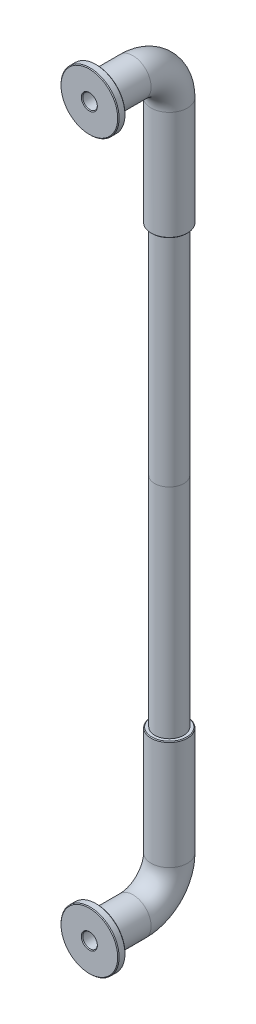
ISO-10303-21;
HEADER;
FILE_DESCRIPTION(('STEP AP214'),'2;1');
FILE_NAME('part.step','',(''),(''),'','','');
FILE_SCHEMA(('AUTOMOTIVE_DESIGN { 1 0 10303 214 1 1 1 1 }'));
ENDSEC;
DATA;
#1=APPLICATION_CONTEXT('core data for automotive mechanical design processes');
#2=APPLICATION_PROTOCOL_DEFINITION('international standard','automotive_design',2000,#1);
#3=PRODUCT_CONTEXT('',#1,'mechanical');
#4=PRODUCT('Part','Part','',(#3));
#5=PRODUCT_RELATED_PRODUCT_CATEGORY('part','',(#4));
#6=PRODUCT_DEFINITION_FORMATION('','',#4);
#7=PRODUCT_DEFINITION_CONTEXT('part definition',#1,'design');
#8=PRODUCT_DEFINITION('design','',#6,#7);
#9=PRODUCT_DEFINITION_SHAPE('','',#8);
#10=(LENGTH_UNIT() NAMED_UNIT(*) SI_UNIT(.MILLI.,.METRE.));
#11=(NAMED_UNIT(*) PLANE_ANGLE_UNIT() SI_UNIT($,.RADIAN.));
#12=(NAMED_UNIT(*) SI_UNIT($,.STERADIAN.) SOLID_ANGLE_UNIT());
#13=UNCERTAINTY_MEASURE_WITH_UNIT(LENGTH_MEASURE(1.E-05),#10,'distance_accuracy_value','');
#14=(GEOMETRIC_REPRESENTATION_CONTEXT(3) GLOBAL_UNCERTAINTY_ASSIGNED_CONTEXT((#13)) GLOBAL_UNIT_ASSIGNED_CONTEXT((#10,
#11,#12)) REPRESENTATION_CONTEXT('',''));
#15=CARTESIAN_POINT('',(0.,0.,0.));
#16=DIRECTION('',(0.,0.,1.));
#17=DIRECTION('',(1.,0.,0.));
#18=AXIS2_PLACEMENT_3D('',#15,#16,#17);
#19=CARTESIAN_POINT('',(0.,-50.,-10.));
#20=DIRECTION('',(0.,-1.,0.));
#21=DIRECTION('',(0.,0.,-1.));
#22=AXIS2_PLACEMENT_3D('',#19,#20,#21);
#23=PLANE('',#22);
#24=CARTESIAN_POINT('',(0.,-50.,-10.));
#25=DIRECTION('',(0.,-1.,0.));
#26=DIRECTION('',(0.,0.,-1.));
#27=AXIS2_PLACEMENT_3D('',#24,#25,#26);
#28=CIRCLE('',#27,2.);
#29=CARTESIAN_POINT('',(0.,-50.,-12.));
#30=VERTEX_POINT('',#29);
#31=EDGE_CURVE('E83',#30,#30,#28,.T.);
#32=ORIENTED_EDGE('',*,*,#31,.F.);
#33=EDGE_LOOP('',(#32));
#34=FACE_BOUND('',#33,.T.);
#35=CARTESIAN_POINT('',(0.,-50.,-10.));
#36=DIRECTION('',(0.,-1.,0.));
#37=DIRECTION('',(0.,0.,-1.));
#38=AXIS2_PLACEMENT_3D('',#35,#36,#37);
#39=CIRCLE('',#38,1.);
#40=CARTESIAN_POINT('',(0.,-50.,-11.));
#41=VERTEX_POINT('',#40);
#42=EDGE_CURVE('E86',#41,#41,#39,.T.);
#43=ORIENTED_EDGE('',*,*,#42,.T.);
#44=EDGE_LOOP('',(#43));
#45=FACE_BOUND('',#44,.T.);
#46=ADVANCED_FACE('F49',(#34,#45),#23,.F.);
#47=CARTESIAN_POINT('',(0.,-80.,-10.));
#48=DIRECTION('',(0.,1.,0.));
#49=DIRECTION('',(0.,0.,1.));
#50=AXIS2_PLACEMENT_3D('',#47,#48,#49);
#51=CYLINDRICAL_SURFACE('',#50,2.);
#52=CARTESIAN_POINT('',(0.,-80.,-10.));
#53=DIRECTION('',(0.,-1.,0.));
#54=DIRECTION('',(0.,0.,-1.));
#55=AXIS2_PLACEMENT_3D('',#52,#53,#54);
#56=CIRCLE('',#55,2.);
#57=CARTESIAN_POINT('',(0.,-80.,-12.));
#58=VERTEX_POINT('',#57);
#59=EDGE_CURVE('E82',#58,#58,#56,.T.);
#60=ORIENTED_EDGE('',*,*,#59,.F.);
#61=EDGE_LOOP('',(#60));
#62=FACE_BOUND('',#61,.T.);
#63=ORIENTED_EDGE('',*,*,#31,.T.);
#64=EDGE_LOOP('',(#63));
#65=FACE_BOUND('',#64,.T.);
#66=ADVANCED_FACE('F112',(#62,#65),#51,.T.);
#67=CARTESIAN_POINT('',(0.,-80.,-10.));
#68=DIRECTION('',(0.,1.,0.));
#69=DIRECTION('',(0.,0.,1.));
#70=AXIS2_PLACEMENT_3D('',#67,#68,#69);
#71=CYLINDRICAL_SURFACE('',#70,1.);
#72=ORIENTED_EDGE('',*,*,#42,.F.);
#73=EDGE_LOOP('',(#72));
#74=FACE_BOUND('',#73,.T.);
#75=CARTESIAN_POINT('',(0.,-95.,-10.));
#76=DIRECTION('',(0.,-1.,0.));
#77=DIRECTION('',(0.,0.,-1.));
#78=AXIS2_PLACEMENT_3D('',#75,#76,#77);
#79=CIRCLE('',#78,1.);
#80=CARTESIAN_POINT('',(0.,-95.,-11.));
#81=VERTEX_POINT('',#80);
#82=EDGE_CURVE('E101',#81,#81,#79,.F.);
#83=ORIENTED_EDGE('',*,*,#82,.F.);
#84=EDGE_LOOP('',(#83));
#85=FACE_BOUND('',#84,.T.);
#86=ADVANCED_FACE('F109',(#74,#85),#71,.F.);
#87=CARTESIAN_POINT('',(0.,-80.,-10.));
#88=DIRECTION('',(0.,-1.,0.));
#89=DIRECTION('',(0.,0.,-1.));
#90=AXIS2_PLACEMENT_3D('',#87,#88,#89);
#91=CYLINDRICAL_SURFACE('',#90,2.5);
#92=CARTESIAN_POINT('',(0.,-80.1,-10.));
#93=DIRECTION('',(0.,-1.,0.));
#94=DIRECTION('',(0.,0.,-1.));
#95=AXIS2_PLACEMENT_3D('',#92,#93,#94);
#96=CIRCLE('',#95,2.5);
#97=CARTESIAN_POINT('',(0.,-80.1,-12.5));
#98=VERTEX_POINT('',#97);
#99=EDGE_CURVE('E79',#98,#98,#96,.T.);
#100=ORIENTED_EDGE('',*,*,#99,.T.);
#101=EDGE_LOOP('',(#100));
#102=FACE_BOUND('',#101,.T.);
#103=CARTESIAN_POINT('',(0.,-95.,-10.));
#104=DIRECTION('',(0.,-1.,0.));
#105=DIRECTION('',(0.,0.,-1.));
#106=AXIS2_PLACEMENT_3D('',#103,#104,#105);
#107=CIRCLE('',#106,2.5);
#108=CARTESIAN_POINT('',(0.,-95.,-12.5));
#109=VERTEX_POINT('',#108);
#110=EDGE_CURVE('E96',#109,#109,#107,.T.);
#111=ORIENTED_EDGE('',*,*,#110,.F.);
#112=EDGE_LOOP('',(#111));
#113=FACE_BOUND('',#112,.T.);
#114=ADVANCED_FACE('F111',(#102,#113),#91,.T.);
#115=CARTESIAN_POINT('',(0.,-95.,-5.));
#116=DIRECTION('',(-1.,0.,0.));
#117=DIRECTION('',(0.,0.,1.));
#118=AXIS2_PLACEMENT_3D('',#115,#116,#117);
#119=TOROIDAL_SURFACE('',#118,5.00000000000001,2.5);
#120=CARTESIAN_POINT('',(0.,-100.,-5.));
#121=DIRECTION('',(0.,0.,1.));
#122=DIRECTION('',(0.,-1.,0.));
#123=AXIS2_PLACEMENT_3D('',#120,#121,#122);
#124=CIRCLE('',#123,2.5);
#125=CARTESIAN_POINT('',(0.,-102.5,-5.00000000000001));
#126=VERTEX_POINT('',#125);
#127=EDGE_CURVE('E92',#126,#126,#124,.T.);
#128=CARTESIAN_POINT('',(0.,-95.,-5.));
#129=DIRECTION('',(-1.,0.,0.));
#130=DIRECTION('',(0.,0.,1.));
#131=AXIS2_PLACEMENT_3D('',#128,#129,#130);
#132=CIRCLE('',#131,7.50000000000001);
#133=EDGE_CURVE('',#109,#126,#132,.T.);
#134=ORIENTED_EDGE('',*,*,#110,.T.);
#135=ORIENTED_EDGE('',*,*,#127,.F.);
#136=ORIENTED_EDGE('',*,*,#133,.T.);
#137=ORIENTED_EDGE('',*,*,#133,.F.);
#138=EDGE_LOOP('',(#134,#136,#135,#137));
#139=FACE_BOUND('',#138,.T.);
#140=ADVANCED_FACE('F120',(#139),#119,.T.);
#141=CARTESIAN_POINT('',(0.,-100.,-5.));
#142=DIRECTION('',(0.,0.,1.));
#143=DIRECTION('',(1.,0.,0.));
#144=AXIS2_PLACEMENT_3D('',#141,#142,#143);
#145=CYLINDRICAL_SURFACE('',#144,2.5);
#146=CARTESIAN_POINT('',(0.,-100.,0.));
#147=DIRECTION('',(0.,0.,1.));
#148=DIRECTION('',(0.,-1.,0.));
#149=AXIS2_PLACEMENT_3D('',#146,#147,#148);
#150=CIRCLE('',#149,2.5);
#151=CARTESIAN_POINT('',(0.,-102.5,0.));
#152=VERTEX_POINT('',#151);
#153=EDGE_CURVE('E95',#152,#152,#150,.T.);
#154=ORIENTED_EDGE('',*,*,#153,.F.);
#155=EDGE_LOOP('',(#154));
#156=FACE_BOUND('',#155,.T.);
#157=ORIENTED_EDGE('',*,*,#127,.T.);
#158=EDGE_LOOP('',(#157));
#159=FACE_BOUND('',#158,.T.);
#160=ADVANCED_FACE('F174',(#156,#159),#145,.T.);
#161=CARTESIAN_POINT('',(0.,-80.,-10.));
#162=DIRECTION('',(0.,-1.,0.));
#163=DIRECTION('',(0.,0.,-1.));
#164=AXIS2_PLACEMENT_3D('',#161,#162,#163);
#165=PLANE('',#164);
#166=CARTESIAN_POINT('',(0.,-80.,-10.));
#167=DIRECTION('',(0.,-1.,0.));
#168=DIRECTION('',(0.,0.,-1.));
#169=AXIS2_PLACEMENT_3D('',#166,#167,#168);
#170=CIRCLE('',#169,2.39999999999999);
#171=CARTESIAN_POINT('',(0.,-80.,-12.4));
#172=VERTEX_POINT('',#171);
#173=EDGE_CURVE('E76',#172,#172,#170,.F.);
#174=ORIENTED_EDGE('',*,*,#173,.T.);
#175=EDGE_LOOP('',(#174));
#176=FACE_BOUND('',#175,.T.);
#177=ORIENTED_EDGE('',*,*,#59,.T.);
#178=EDGE_LOOP('',(#177));
#179=FACE_BOUND('',#178,.T.);
#180=ADVANCED_FACE('F169',(#176,#179),#165,.F.);
#181=CARTESIAN_POINT('',(0.,-95.,-5.));
#182=DIRECTION('',(-1.,0.,0.));
#183=DIRECTION('',(0.,0.,1.));
#184=AXIS2_PLACEMENT_3D('',#181,#182,#183);
#185=TOROIDAL_SURFACE('',#184,5.00000000000001,1.);
#186=CARTESIAN_POINT('',(0.,-100.,-5.));
#187=DIRECTION('',(0.,0.,1.));
#188=DIRECTION('',(0.,-1.,0.));
#189=AXIS2_PLACEMENT_3D('',#186,#187,#188);
#190=CIRCLE('',#189,1.);
#191=CARTESIAN_POINT('',(0.,-101.,-5.00000000000001));
#192=VERTEX_POINT('',#191);
#193=EDGE_CURVE('E91',#192,#192,#190,.F.);
#194=CARTESIAN_POINT('',(0.,-95.,-5.));
#195=DIRECTION('',(-1.,0.,0.));
#196=DIRECTION('',(0.,0.,1.));
#197=AXIS2_PLACEMENT_3D('',#194,#195,#196);
#198=CIRCLE('',#197,6.00000000000001);
#199=EDGE_CURVE('',#81,#192,#198,.T.);
#200=ORIENTED_EDGE('',*,*,#82,.T.);
#201=ORIENTED_EDGE('',*,*,#193,.F.);
#202=ORIENTED_EDGE('',*,*,#199,.T.);
#203=ORIENTED_EDGE('',*,*,#199,.F.);
#204=EDGE_LOOP('',(#200,#202,#201,#203));
#205=FACE_BOUND('',#204,.T.);
#206=ADVANCED_FACE('F107',(#205),#185,.F.);
#207=CARTESIAN_POINT('',(0.,-100.,-5.));
#208=DIRECTION('',(0.,0.,1.));
#209=DIRECTION('',(1.,0.,0.));
#210=AXIS2_PLACEMENT_3D('',#207,#208,#209);
#211=CYLINDRICAL_SURFACE('',#210,1.);
#212=CARTESIAN_POINT('',(0.,-100.,0.899999999999972));
#213=DIRECTION('',(0.,0.,1.));
#214=DIRECTION('',(1.,0.,0.));
#215=AXIS2_PLACEMENT_3D('',#212,#213,#214);
#216=CIRCLE('',#215,1.);
#217=CARTESIAN_POINT('',(1.,-100.,0.899999999999972));
#218=VERTEX_POINT('',#217);
#219=EDGE_CURVE('E61',#218,#218,#216,.T.);
#220=ORIENTED_EDGE('',*,*,#219,.T.);
#221=EDGE_LOOP('',(#220));
#222=FACE_BOUND('',#221,.T.);
#223=ORIENTED_EDGE('',*,*,#193,.T.);
#224=EDGE_LOOP('',(#223));
#225=FACE_BOUND('',#224,.T.);
#226=ADVANCED_FACE('F115',(#222,#225),#211,.F.);
#227=CARTESIAN_POINT('',(0.,-80.1,-10.));
#228=DIRECTION('',(0.,-1.,0.));
#229=DIRECTION('',(0.,0.,-1.));
#230=AXIS2_PLACEMENT_3D('',#227,#228,#229);
#231=CONICAL_SURFACE('',#230,2.5,0.785398163397468);
#232=ORIENTED_EDGE('',*,*,#173,.F.);
#233=EDGE_LOOP('',(#232));
#234=FACE_BOUND('',#233,.T.);
#235=ORIENTED_EDGE('',*,*,#99,.F.);
#236=EDGE_LOOP('',(#235));
#237=FACE_BOUND('',#236,.T.);
#238=ADVANCED_FACE('F123',(#234,#237),#231,.T.);
#239=CARTESIAN_POINT('',(0.,-100.,1.));
#240=DIRECTION('',(0.,0.,1.));
#241=DIRECTION('',(1.,0.,0.));
#242=AXIS2_PLACEMENT_3D('',#239,#240,#241);
#243=PLANE('',#242);
#244=CARTESIAN_POINT('',(0.,-100.,1.));
#245=DIRECTION('',(0.,0.,1.));
#246=DIRECTION('',(1.,0.,0.));
#247=AXIS2_PLACEMENT_3D('',#244,#245,#246);
#248=CIRCLE('',#247,1.10000000000003);
#249=CARTESIAN_POINT('',(1.10000000000003,-100.,1.));
#250=VERTEX_POINT('',#249);
#251=EDGE_CURVE('E11',#250,#250,#248,.F.);
#252=ORIENTED_EDGE('',*,*,#251,.T.);
#253=EDGE_LOOP('',(#252));
#254=FACE_BOUND('',#253,.T.);
#255=CARTESIAN_POINT('',(0.,-100.,1.));
#256=DIRECTION('',(0.,0.,1.));
#257=DIRECTION('',(1.,0.,0.));
#258=AXIS2_PLACEMENT_3D('',#255,#256,#257);
#259=CIRCLE('',#258,3.89999999999999);
#260=CARTESIAN_POINT('',(3.89999999999999,-100.,1.));
#261=VERTEX_POINT('',#260);
#262=EDGE_CURVE('E57',#261,#261,#259,.T.);
#263=ORIENTED_EDGE('',*,*,#262,.T.);
#264=EDGE_LOOP('',(#263));
#265=FACE_BOUND('',#264,.T.);
#266=ADVANCED_FACE('F145',(#254,#265),#243,.T.);
#267=CARTESIAN_POINT('',(0.,-100.,0.));
#268=DIRECTION('',(0.,0.,1.));
#269=DIRECTION('',(1.,0.,0.));
#270=AXIS2_PLACEMENT_3D('',#267,#268,#269);
#271=PLANE('',#270);
#272=CARTESIAN_POINT('',(0.,-100.,0.));
#273=DIRECTION('',(0.,0.,1.));
#274=DIRECTION('',(1.,0.,0.));
#275=AXIS2_PLACEMENT_3D('',#272,#273,#274);
#276=CIRCLE('',#275,3.9);
#277=CARTESIAN_POINT('',(3.9,-100.,0.));
#278=VERTEX_POINT('',#277);
#279=EDGE_CURVE('E65',#278,#278,#276,.F.);
#280=ORIENTED_EDGE('',*,*,#279,.T.);
#281=EDGE_LOOP('',(#280));
#282=FACE_BOUND('',#281,.T.);
#283=ORIENTED_EDGE('',*,*,#153,.T.);
#284=EDGE_LOOP('',(#283));
#285=FACE_BOUND('',#284,.T.);
#286=ADVANCED_FACE('F193',(#282,#285),#271,.F.);
#287=CARTESIAN_POINT('',(0.,-100.,1.));
#288=DIRECTION('',(0.,0.,-1.));
#289=DIRECTION('',(-1.,0.,0.));
#290=AXIS2_PLACEMENT_3D('',#287,#288,#289);
#291=CYLINDRICAL_SURFACE('',#290,4.);
#292=CARTESIAN_POINT('',(0.,-100.,0.100000000000007));
#293=DIRECTION('',(0.,0.,1.));
#294=DIRECTION('',(1.,0.,0.));
#295=AXIS2_PLACEMENT_3D('',#292,#293,#294);
#296=CIRCLE('',#295,4.);
#297=CARTESIAN_POINT('',(4.,-100.,0.100000000000007));
#298=VERTEX_POINT('',#297);
#299=EDGE_CURVE('E70',#298,#298,#296,.T.);
#300=ORIENTED_EDGE('',*,*,#299,.T.);
#301=EDGE_LOOP('',(#300));
#302=FACE_BOUND('',#301,.T.);
#303=CARTESIAN_POINT('',(0.,-100.,0.9));
#304=DIRECTION('',(0.,0.,1.));
#305=DIRECTION('',(1.,0.,0.));
#306=AXIS2_PLACEMENT_3D('',#303,#304,#305);
#307=CIRCLE('',#306,4.);
#308=CARTESIAN_POINT('',(4.,-100.,0.9));
#309=VERTEX_POINT('',#308);
#310=EDGE_CURVE('E73',#309,#309,#307,.F.);
#311=ORIENTED_EDGE('',*,*,#310,.T.);
#312=EDGE_LOOP('',(#311));
#313=FACE_BOUND('',#312,.T.);
#314=ADVANCED_FACE('F153',(#302,#313),#291,.T.);
#315=CARTESIAN_POINT('',(0.,-100.,0.100000000000007));
#316=DIRECTION('',(0.,0.,1.));
#317=DIRECTION('',(1.,0.,0.));
#318=AXIS2_PLACEMENT_3D('',#315,#316,#317);
#319=CONICAL_SURFACE('',#318,4.,0.785398163397414);
#320=ORIENTED_EDGE('',*,*,#279,.F.);
#321=EDGE_LOOP('',(#320));
#322=FACE_BOUND('',#321,.T.);
#323=ORIENTED_EDGE('',*,*,#299,.F.);
#324=EDGE_LOOP('',(#323));
#325=FACE_BOUND('',#324,.T.);
#326=ADVANCED_FACE('F147',(#322,#325),#319,.T.);
#327=CARTESIAN_POINT('',(0.,-100.,0.899999999999972));
#328=DIRECTION('',(0.,0.,1.));
#329=DIRECTION('',(1.,0.,0.));
#330=AXIS2_PLACEMENT_3D('',#327,#328,#329);
#331=CONICAL_SURFACE('',#330,1.,0.785398163397458);
#332=ORIENTED_EDGE('',*,*,#251,.F.);
#333=EDGE_LOOP('',(#332));
#334=FACE_BOUND('',#333,.T.);
#335=ORIENTED_EDGE('',*,*,#219,.F.);
#336=EDGE_LOOP('',(#335));
#337=FACE_BOUND('',#336,.T.);
#338=ADVANCED_FACE('F152',(#334,#337),#331,.F.);
#339=CARTESIAN_POINT('',(0.,-100.,1.));
#340=DIRECTION('',(0.,0.,-1.));
#341=DIRECTION('',(-1.,0.,0.));
#342=AXIS2_PLACEMENT_3D('',#339,#340,#341);
#343=CONICAL_SURFACE('',#342,3.89999999999999,0.785398163397483);
#344=ORIENTED_EDGE('',*,*,#310,.F.);
#345=EDGE_LOOP('',(#344));
#346=FACE_BOUND('',#345,.T.);
#347=ORIENTED_EDGE('',*,*,#262,.F.);
#348=EDGE_LOOP('',(#347));
#349=FACE_BOUND('',#348,.T.);
#350=ADVANCED_FACE('F52',(#346,#349),#343,.T.);
#351=CLOSED_SHELL('',(#46,#66,#86,#114,#140,#160,#180,#206,#226,#238,#266,#286,#314,#326,#338,#350));
#352=MANIFOLD_SOLID_BREP('B2',#351);
#353=CARTESIAN_POINT('',(0.,0.,0.));
#354=DIRECTION('',(0.,0.,-1.));
#355=DIRECTION('',(-1.,0.,0.));
#356=AXIS2_PLACEMENT_3D('',#353,#354,#355);
#357=CYLINDRICAL_SURFACE('',#356,2.5);
#358=CARTESIAN_POINT('',(0.,0.,-5.));
#359=DIRECTION('',(0.,0.,1.));
#360=DIRECTION('',(1.,0.,0.));
#361=AXIS2_PLACEMENT_3D('',#358,#359,#360);
#362=CIRCLE('',#361,2.5);
#363=CARTESIAN_POINT('',(0.,2.5,-5.));
#364=VERTEX_POINT('',#363);
#365=EDGE_CURVE('E361',#364,#364,#362,.T.);
#366=ORIENTED_EDGE('',*,*,#365,.T.);
#367=EDGE_LOOP('',(#366));
#368=FACE_BOUND('',#367,.T.);
#369=CARTESIAN_POINT('',(0.,0.,0.));
#370=DIRECTION('',(0.,0.,1.));
#371=DIRECTION('',(1.,0.,0.));
#372=AXIS2_PLACEMENT_3D('',#369,#370,#371);
#373=CIRCLE('',#372,2.5);
#374=CARTESIAN_POINT('',(2.5,0.,0.));
#375=VERTEX_POINT('',#374);
#376=EDGE_CURVE('E360',#375,#375,#373,.T.);
#377=ORIENTED_EDGE('',*,*,#376,.F.);
#378=EDGE_LOOP('',(#377));
#379=FACE_BOUND('',#378,.T.);
#380=ADVANCED_FACE('F313',(#368,#379),#357,.T.);
#381=CARTESIAN_POINT('',(0.,-5.,-5.));
#382=DIRECTION('',(-1.,0.,0.));
#383=DIRECTION('',(0.,0.,1.));
#384=AXIS2_PLACEMENT_3D('',#381,#382,#383);
#385=TOROIDAL_SURFACE('',#384,5.,2.5);
#386=CARTESIAN_POINT('',(0.,-5.,-10.));
#387=DIRECTION('',(0.,1.,0.));
#388=DIRECTION('',(1.,0.,0.));
#389=AXIS2_PLACEMENT_3D('',#386,#387,#388);
#390=CIRCLE('',#389,2.5);
#391=CARTESIAN_POINT('',(0.,-5.,-12.5));
#392=VERTEX_POINT('',#391);
#393=EDGE_CURVE('E356',#392,#392,#390,.T.);
#394=CARTESIAN_POINT('',(0.,-5.,-5.));
#395=DIRECTION('',(-1.,0.,0.));
#396=DIRECTION('',(0.,0.,1.));
#397=AXIS2_PLACEMENT_3D('',#394,#395,#396);
#398=CIRCLE('',#397,7.5);
#399=EDGE_CURVE('',#364,#392,#398,.T.);
#400=ORIENTED_EDGE('',*,*,#365,.F.);
#401=ORIENTED_EDGE('',*,*,#393,.T.);
#402=ORIENTED_EDGE('',*,*,#399,.T.);
#403=ORIENTED_EDGE('',*,*,#399,.F.);
#404=EDGE_LOOP('',(#400,#402,#401,#403));
#405=FACE_BOUND('',#404,.T.);
#406=ADVANCED_FACE('F425',(#405),#385,.T.);
#407=CARTESIAN_POINT('',(0.,-5.,-10.));
#408=DIRECTION('',(0.,-1.,0.));
#409=DIRECTION('',(0.,0.,-1.));
#410=AXIS2_PLACEMENT_3D('',#407,#408,#409);
#411=CYLINDRICAL_SURFACE('',#410,2.5);
#412=CARTESIAN_POINT('',(0.,-19.9,-10.));
#413=DIRECTION('',(0.,1.,0.));
#414=DIRECTION('',(0.,0.,1.));
#415=AXIS2_PLACEMENT_3D('',#412,#413,#414);
#416=CIRCLE('',#415,2.5);
#417=CARTESIAN_POINT('',(0.,-19.9,-7.5));
#418=VERTEX_POINT('',#417);
#419=EDGE_CURVE('E351',#418,#418,#416,.T.);
#420=ORIENTED_EDGE('',*,*,#419,.T.);
#421=EDGE_LOOP('',(#420));
#422=FACE_BOUND('',#421,.T.);
#423=ORIENTED_EDGE('',*,*,#393,.F.);
#424=EDGE_LOOP('',(#423));
#425=FACE_BOUND('',#424,.T.);
#426=ADVANCED_FACE('F421',(#422,#425),#411,.T.);
#427=CARTESIAN_POINT('',(0.,-20.,-10.));
#428=DIRECTION('',(0.,1.,0.));
#429=DIRECTION('',(1.,0.,0.));
#430=AXIS2_PLACEMENT_3D('',#427,#428,#429);
#431=PLANE('',#430);
#432=CARTESIAN_POINT('',(0.,-20.,-10.));
#433=DIRECTION('',(0.,-1.,0.));
#434=DIRECTION('',(0.,0.,-1.));
#435=AXIS2_PLACEMENT_3D('',#432,#433,#434);
#436=CIRCLE('',#435,2.);
#437=CARTESIAN_POINT('',(0.,-20.,-12.));
#438=VERTEX_POINT('',#437);
#439=EDGE_CURVE('E346',#438,#438,#436,.T.);
#440=ORIENTED_EDGE('',*,*,#439,.F.);
#441=EDGE_LOOP('',(#440));
#442=FACE_BOUND('',#441,.T.);
#443=CARTESIAN_POINT('',(0.,-20.,-10.));
#444=DIRECTION('',(0.,1.,0.));
#445=DIRECTION('',(0.,0.,1.));
#446=AXIS2_PLACEMENT_3D('',#443,#444,#445);
#447=CIRCLE('',#446,2.39999999999999);
#448=CARTESIAN_POINT('',(0.,-20.,-7.60000000000001));
#449=VERTEX_POINT('',#448);
#450=EDGE_CURVE('E347',#449,#449,#447,.F.);
#451=ORIENTED_EDGE('',*,*,#450,.T.);
#452=EDGE_LOOP('',(#451));
#453=FACE_BOUND('',#452,.T.);
#454=ADVANCED_FACE('F418',(#442,#453),#431,.F.);
#455=CARTESIAN_POINT('',(0.,0.,0.));
#456=DIRECTION('',(0.,0.,-1.));
#457=DIRECTION('',(-1.,0.,0.));
#458=AXIS2_PLACEMENT_3D('',#455,#456,#457);
#459=CYLINDRICAL_SURFACE('',#458,1.);
#460=CARTESIAN_POINT('',(0.,0.,0.899999999999998));
#461=DIRECTION('',(0.,0.,1.));
#462=DIRECTION('',(1.,0.,0.));
#463=AXIS2_PLACEMENT_3D('',#460,#461,#462);
#464=CIRCLE('',#463,1.);
#465=CARTESIAN_POINT('',(1.,0.,0.899999999999998));
#466=VERTEX_POINT('',#465);
#467=EDGE_CURVE('E342',#466,#466,#464,.T.);
#468=ORIENTED_EDGE('',*,*,#467,.T.);
#469=EDGE_LOOP('',(#468));
#470=FACE_BOUND('',#469,.T.);
#471=CARTESIAN_POINT('',(0.,0.,-5.));
#472=DIRECTION('',(0.,0.,1.));
#473=DIRECTION('',(1.,0.,0.));
#474=AXIS2_PLACEMENT_3D('',#471,#472,#473);
#475=CIRCLE('',#474,1.);
#476=CARTESIAN_POINT('',(0.,0.999999999999999,-5.));
#477=VERTEX_POINT('',#476);
#478=EDGE_CURVE('E369',#477,#477,#475,.F.);
#479=ORIENTED_EDGE('',*,*,#478,.T.);
#480=EDGE_LOOP('',(#479));
#481=FACE_BOUND('',#480,.T.);
#482=ADVANCED_FACE('F412',(#470,#481),#459,.F.);
#483=CARTESIAN_POINT('',(0.,-5.,-5.));
#484=DIRECTION('',(-1.,0.,0.));
#485=DIRECTION('',(0.,0.,1.));
#486=AXIS2_PLACEMENT_3D('',#483,#484,#485);
#487=TOROIDAL_SURFACE('',#486,5.,1.);
#488=CARTESIAN_POINT('',(0.,-5.,-10.));
#489=DIRECTION('',(0.,1.,0.));
#490=DIRECTION('',(1.,0.,0.));
#491=AXIS2_PLACEMENT_3D('',#488,#489,#490);
#492=CIRCLE('',#491,1.);
#493=CARTESIAN_POINT('',(0.,-5.,-11.));
#494=VERTEX_POINT('',#493);
#495=EDGE_CURVE('E355',#494,#494,#492,.F.);
#496=CARTESIAN_POINT('',(0.,-5.,-5.));
#497=DIRECTION('',(-1.,0.,0.));
#498=DIRECTION('',(0.,0.,1.));
#499=AXIS2_PLACEMENT_3D('',#496,#497,#498);
#500=CIRCLE('',#499,6.);
#501=EDGE_CURVE('',#477,#494,#500,.T.);
#502=ORIENTED_EDGE('',*,*,#478,.F.);
#503=ORIENTED_EDGE('',*,*,#495,.T.);
#504=ORIENTED_EDGE('',*,*,#501,.T.);
#505=ORIENTED_EDGE('',*,*,#501,.F.);
#506=EDGE_LOOP('',(#502,#504,#503,#505));
#507=FACE_BOUND('',#506,.T.);
#508=ADVANCED_FACE('F406',(#507),#487,.F.);
#509=CARTESIAN_POINT('',(0.,-5.,-10.));
#510=DIRECTION('',(0.,-1.,0.));
#511=DIRECTION('',(0.,0.,-1.));
#512=AXIS2_PLACEMENT_3D('',#509,#510,#511);
#513=CYLINDRICAL_SURFACE('',#512,1.);
#514=ORIENTED_EDGE('',*,*,#495,.F.);
#515=EDGE_LOOP('',(#514));
#516=FACE_BOUND('',#515,.T.);
#517=CARTESIAN_POINT('',(0.,-50.,-10.));
#518=DIRECTION('',(0.,-1.,0.));
#519=DIRECTION('',(0.,0.,-1.));
#520=AXIS2_PLACEMENT_3D('',#517,#518,#519);
#521=CIRCLE('',#520,1.);
#522=CARTESIAN_POINT('',(0.,-50.,-11.));
#523=VERTEX_POINT('',#522);
#524=EDGE_CURVE('E382',#523,#523,#521,.T.);
#525=ORIENTED_EDGE('',*,*,#524,.T.);
#526=EDGE_LOOP('',(#525));
#527=FACE_BOUND('',#526,.T.);
#528=ADVANCED_FACE('F387',(#516,#527),#513,.F.);
#529=CARTESIAN_POINT('',(0.,-19.9,-10.));
#530=DIRECTION('',(0.,1.,0.));
#531=DIRECTION('',(0.,0.,1.));
#532=AXIS2_PLACEMENT_3D('',#529,#530,#531);
#533=CONICAL_SURFACE('',#532,2.5,0.785398163397453);
#534=ORIENTED_EDGE('',*,*,#450,.F.);
#535=EDGE_LOOP('',(#534));
#536=FACE_BOUND('',#535,.T.);
#537=ORIENTED_EDGE('',*,*,#419,.F.);
#538=EDGE_LOOP('',(#537));
#539=FACE_BOUND('',#538,.T.);
#540=ADVANCED_FACE('F392',(#536,#539),#533,.T.);
#541=CARTESIAN_POINT('',(0.,-50.,-10.));
#542=DIRECTION('',(0.,-1.,0.));
#543=DIRECTION('',(0.,0.,-1.));
#544=AXIS2_PLACEMENT_3D('',#541,#542,#543);
#545=PLANE('',#544);
#546=CARTESIAN_POINT('',(0.,-50.,-10.));
#547=DIRECTION('',(0.,-1.,0.));
#548=DIRECTION('',(0.,0.,-1.));
#549=AXIS2_PLACEMENT_3D('',#546,#547,#548);
#550=CIRCLE('',#549,2.);
#551=CARTESIAN_POINT('',(0.,-50.,-12.));
#552=VERTEX_POINT('',#551);
#553=EDGE_CURVE('E365',#552,#552,#550,.T.);
#554=ORIENTED_EDGE('',*,*,#553,.T.);
#555=EDGE_LOOP('',(#554));
#556=FACE_BOUND('',#555,.T.);
#557=ORIENTED_EDGE('',*,*,#524,.F.);
#558=EDGE_LOOP('',(#557));
#559=FACE_BOUND('',#558,.T.);
#560=ADVANCED_FACE('F389',(#556,#559),#545,.T.);
#561=CARTESIAN_POINT('',(0.,-50.,-10.));
#562=DIRECTION('',(0.,1.,0.));
#563=DIRECTION('',(0.,0.,1.));
#564=AXIS2_PLACEMENT_3D('',#561,#562,#563);
#565=CYLINDRICAL_SURFACE('',#564,2.);
#566=ORIENTED_EDGE('',*,*,#553,.F.);
#567=EDGE_LOOP('',(#566));
#568=FACE_BOUND('',#567,.T.);
#569=ORIENTED_EDGE('',*,*,#439,.T.);
#570=EDGE_LOOP('',(#569));
#571=FACE_BOUND('',#570,.T.);
#572=ADVANCED_FACE('F391',(#568,#571),#565,.T.);
#573=CARTESIAN_POINT('',(0.,0.,1.));
#574=DIRECTION('',(0.,0.,1.));
#575=DIRECTION('',(1.,0.,0.));
#576=AXIS2_PLACEMENT_3D('',#573,#574,#575);
#577=PLANE('',#576);
#578=CARTESIAN_POINT('',(0.,0.,1.));
#579=DIRECTION('',(0.,0.,1.));
#580=DIRECTION('',(1.,0.,0.));
#581=AXIS2_PLACEMENT_3D('',#578,#579,#580);
#582=CIRCLE('',#581,1.1);
#583=CARTESIAN_POINT('',(1.1,0.,1.));
#584=VERTEX_POINT('',#583);
#585=EDGE_CURVE('E332',#584,#584,#582,.F.);
#586=ORIENTED_EDGE('',*,*,#585,.T.);
#587=EDGE_LOOP('',(#586));
#588=FACE_BOUND('',#587,.T.);
#589=CARTESIAN_POINT('',(0.,0.,1.));
#590=DIRECTION('',(0.,0.,1.));
#591=DIRECTION('',(1.,0.,0.));
#592=AXIS2_PLACEMENT_3D('',#589,#590,#591);
#593=CIRCLE('',#592,3.89999999999999);
#594=CARTESIAN_POINT('',(3.89999999999999,0.,1.));
#595=VERTEX_POINT('',#594);
#596=EDGE_CURVE('E338',#595,#595,#593,.T.);
#597=ORIENTED_EDGE('',*,*,#596,.T.);
#598=EDGE_LOOP('',(#597));
#599=FACE_BOUND('',#598,.T.);
#600=ADVANCED_FACE('F399',(#588,#599),#577,.T.);
#601=CARTESIAN_POINT('',(0.,0.,0.));
#602=DIRECTION('',(0.,0.,1.));
#603=DIRECTION('',(1.,0.,0.));
#604=AXIS2_PLACEMENT_3D('',#601,#602,#603);
#605=PLANE('',#604);
#606=CARTESIAN_POINT('',(0.,0.,0.));
#607=DIRECTION('',(0.,0.,1.));
#608=DIRECTION('',(1.,0.,0.));
#609=AXIS2_PLACEMENT_3D('',#606,#607,#608);
#610=CIRCLE('',#609,3.9);
#611=CARTESIAN_POINT('',(3.9,0.,0.));
#612=VERTEX_POINT('',#611);
#613=EDGE_CURVE('E48',#612,#612,#610,.F.);
#614=ORIENTED_EDGE('',*,*,#613,.T.);
#615=EDGE_LOOP('',(#614));
#616=FACE_BOUND('',#615,.T.);
#617=ORIENTED_EDGE('',*,*,#376,.T.);
#618=EDGE_LOOP('',(#617));
#619=FACE_BOUND('',#618,.T.);
#620=ADVANCED_FACE('F457',(#616,#619),#605,.F.);
#621=CARTESIAN_POINT('',(0.,0.,1.));
#622=DIRECTION('',(0.,0.,-1.));
#623=DIRECTION('',(-1.,0.,0.));
#624=AXIS2_PLACEMENT_3D('',#621,#622,#623);
#625=CYLINDRICAL_SURFACE('',#624,4.);
#626=CARTESIAN_POINT('',(0.,0.,0.900000000000001));
#627=DIRECTION('',(0.,0.,1.));
#628=DIRECTION('',(1.,0.,0.));
#629=AXIS2_PLACEMENT_3D('',#626,#627,#628);
#630=CIRCLE('',#629,4.);
#631=CARTESIAN_POINT('',(4.,0.,0.900000000000001));
#632=VERTEX_POINT('',#631);
#633=EDGE_CURVE('E322',#632,#632,#630,.F.);
#634=ORIENTED_EDGE('',*,*,#633,.T.);
#635=EDGE_LOOP('',(#634));
#636=FACE_BOUND('',#635,.T.);
#637=CARTESIAN_POINT('',(0.,0.,0.100000000000006));
#638=DIRECTION('',(0.,0.,1.));
#639=DIRECTION('',(1.,0.,0.));
#640=AXIS2_PLACEMENT_3D('',#637,#638,#639);
#641=CIRCLE('',#640,4.);
#642=CARTESIAN_POINT('',(4.,0.,0.100000000000006));
#643=VERTEX_POINT('',#642);
#644=EDGE_CURVE('E327',#643,#643,#641,.T.);
#645=ORIENTED_EDGE('',*,*,#644,.T.);
#646=EDGE_LOOP('',(#645));
#647=FACE_BOUND('',#646,.T.);
#648=ADVANCED_FACE('F443',(#636,#647),#625,.T.);
#649=CARTESIAN_POINT('',(0.,0.,0.899999999999998));
#650=DIRECTION('',(0.,0.,1.));
#651=DIRECTION('',(1.,0.,0.));
#652=AXIS2_PLACEMENT_3D('',#649,#650,#651);
#653=CONICAL_SURFACE('',#652,1.,0.785398163397456);
#654=ORIENTED_EDGE('',*,*,#585,.F.);
#655=EDGE_LOOP('',(#654));
#656=FACE_BOUND('',#655,.T.);
#657=ORIENTED_EDGE('',*,*,#467,.F.);
#658=EDGE_LOOP('',(#657));
#659=FACE_BOUND('',#658,.T.);
#660=ADVANCED_FACE('F437',(#656,#659),#653,.F.);
#661=CARTESIAN_POINT('',(0.,0.,1.));
#662=DIRECTION('',(0.,0.,-1.));
#663=DIRECTION('',(-1.,0.,0.));
#664=AXIS2_PLACEMENT_3D('',#661,#662,#663);
#665=CONICAL_SURFACE('',#664,3.89999999999999,0.785398163397483);
#666=ORIENTED_EDGE('',*,*,#633,.F.);
#667=EDGE_LOOP('',(#666));
#668=FACE_BOUND('',#667,.T.);
#669=ORIENTED_EDGE('',*,*,#596,.F.);
#670=EDGE_LOOP('',(#669));
#671=FACE_BOUND('',#670,.T.);
#672=ADVANCED_FACE('F442',(#668,#671),#665,.T.);
#673=CARTESIAN_POINT('',(0.,0.,0.100000000000006));
#674=DIRECTION('',(0.,0.,1.));
#675=DIRECTION('',(1.,0.,0.));
#676=AXIS2_PLACEMENT_3D('',#673,#674,#675);
#677=CONICAL_SURFACE('',#676,4.,0.785398163397414);
#678=ORIENTED_EDGE('',*,*,#613,.F.);
#679=EDGE_LOOP('',(#678));
#680=FACE_BOUND('',#679,.T.);
#681=ORIENTED_EDGE('',*,*,#644,.F.);
#682=EDGE_LOOP('',(#681));
#683=FACE_BOUND('',#682,.T.);
#684=ADVANCED_FACE('F316',(#680,#683),#677,.T.);
#685=CLOSED_SHELL('',(#380,#406,#426,#454,#482,#508,#528,#540,#560,#572,#600,#620,#648,#660,
#672,#684));
#686=MANIFOLD_SOLID_BREP('B6',#685);
#687=ADVANCED_BREP_SHAPE_REPRESENTATION('',(#18,#352,#686),#14);
#688=SHAPE_DEFINITION_REPRESENTATION(#9,#687);
ENDSEC;
END-ISO-10303-21;
